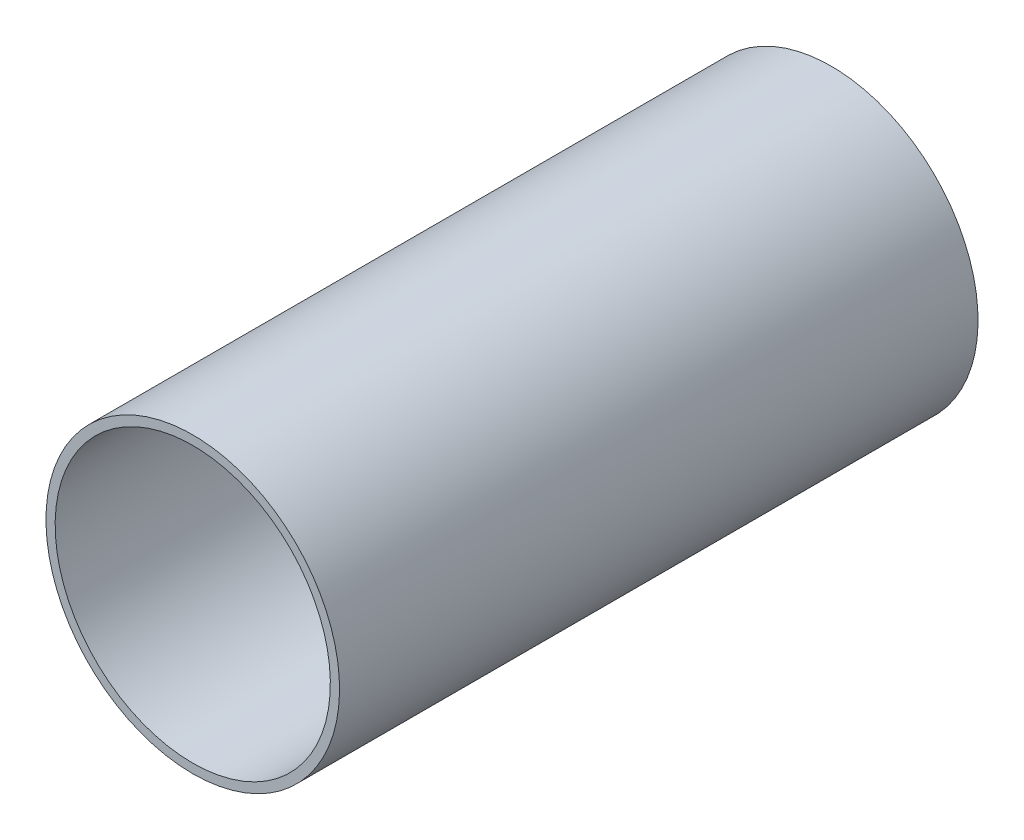
ISO-10303-21;
HEADER;
FILE_DESCRIPTION(('STEP AP214'),'2;1');
FILE_NAME('part.step','',(''),(''),'','','');
FILE_SCHEMA(('AUTOMOTIVE_DESIGN { 1 0 10303 214 1 1 1 1 }'));
ENDSEC;
DATA;
#1=APPLICATION_CONTEXT('core data for automotive mechanical design processes');
#2=APPLICATION_PROTOCOL_DEFINITION('international standard','automotive_design',2000,#1);
#3=PRODUCT_CONTEXT('',#1,'mechanical');
#4=PRODUCT('Part','Part','',(#3));
#5=PRODUCT_RELATED_PRODUCT_CATEGORY('part','',(#4));
#6=PRODUCT_DEFINITION_FORMATION('','',#4);
#7=PRODUCT_DEFINITION_CONTEXT('part definition',#1,'design');
#8=PRODUCT_DEFINITION('design','',#6,#7);
#9=PRODUCT_DEFINITION_SHAPE('','',#8);
#10=(LENGTH_UNIT() NAMED_UNIT(*) SI_UNIT(.MILLI.,.METRE.));
#11=(NAMED_UNIT(*) PLANE_ANGLE_UNIT() SI_UNIT($,.RADIAN.));
#12=(NAMED_UNIT(*) SI_UNIT($,.STERADIAN.) SOLID_ANGLE_UNIT());
#13=UNCERTAINTY_MEASURE_WITH_UNIT(LENGTH_MEASURE(1.E-05),#10,'distance_accuracy_value','');
#14=(GEOMETRIC_REPRESENTATION_CONTEXT(3) GLOBAL_UNCERTAINTY_ASSIGNED_CONTEXT((#13)) GLOBAL_UNIT_ASSIGNED_CONTEXT((#10,
#11,#12)) REPRESENTATION_CONTEXT('',''));
#15=CARTESIAN_POINT('',(0.,0.,0.));
#16=DIRECTION('',(0.,0.,1.));
#17=DIRECTION('',(1.,0.,0.));
#18=AXIS2_PLACEMENT_3D('',#15,#16,#17);
#19=CARTESIAN_POINT('',(141.224,-73.152,-0.045));
#20=DIRECTION('',(0.,0.,-1.));
#21=DIRECTION('',(0.,-1.,0.));
#22=AXIS2_PLACEMENT_3D('',#19,#20,#21);
#23=CYLINDRICAL_SURFACE('',#22,0.375);
#24=CARTESIAN_POINT('',(141.224,-73.152,-0.035));
#25=DIRECTION('',(0.,0.,-1.));
#26=DIRECTION('',(0.,-1.,0.));
#27=AXIS2_PLACEMENT_3D('',#24,#25,#26);
#28=CIRCLE('',#27,0.375);
#29=CARTESIAN_POINT('',(141.224,-73.527,-0.035));
#30=VERTEX_POINT('',#29);
#31=EDGE_CURVE('E64',#30,#30,#28,.T.);
#32=ORIENTED_EDGE('',*,*,#31,.T.);
#33=DIRECTION('',(0.,0.,1.));
#34=VECTOR('',#33,1.);
#35=CARTESIAN_POINT('',(141.224,-73.527,-0.045));
#36=LINE('',#35,#34);
#37=CARTESIAN_POINT('',(141.224,-73.527,1.705));
#38=VERTEX_POINT('',#37);
#39=EDGE_CURVE('E11',#30,#38,#36,.T.);
#40=ORIENTED_EDGE('',*,*,#39,.T.);
#41=CARTESIAN_POINT('',(141.224,-73.152,1.705));
#42=DIRECTION('',(0.,0.,-1.));
#43=DIRECTION('',(0.,-1.,0.));
#44=AXIS2_PLACEMENT_3D('',#41,#42,#43);
#45=CIRCLE('',#44,0.375);
#46=EDGE_CURVE('E25',#38,#38,#45,.T.);
#47=ORIENTED_EDGE('',*,*,#46,.F.);
#48=ORIENTED_EDGE('',*,*,#39,.F.);
#49=EDGE_LOOP('',(#32,#40,#47,#48));
#50=FACE_BOUND('',#49,.T.);
#51=ADVANCED_FACE('F17',(#50),#23,.F.);
#52=CARTESIAN_POINT('',(141.224,-73.552,1.705));
#53=DIRECTION('',(0.,0.,1.));
#54=DIRECTION('',(1.,0.,0.));
#55=AXIS2_PLACEMENT_3D('',#52,#53,#54);
#56=PLANE('',#55);
#57=ORIENTED_EDGE('',*,*,#46,.T.);
#58=EDGE_LOOP('',(#57));
#59=FACE_BOUND('',#58,.T.);
#60=CARTESIAN_POINT('',(141.224,-73.152,1.705));
#61=DIRECTION('',(0.,0.,1.));
#62=DIRECTION('',(0.,-1.,0.));
#63=AXIS2_PLACEMENT_3D('',#60,#61,#62);
#64=CIRCLE('',#63,0.4);
#65=CARTESIAN_POINT('',(141.224,-73.552,1.705));
#66=VERTEX_POINT('',#65);
#67=EDGE_CURVE('E56',#66,#66,#64,.T.);
#68=ORIENTED_EDGE('',*,*,#67,.T.);
#69=EDGE_LOOP('',(#68));
#70=FACE_BOUND('',#69,.T.);
#71=ADVANCED_FACE('F76',(#59,#70),#56,.T.);
#72=CARTESIAN_POINT('',(141.224,-73.552,-0.035));
#73=DIRECTION('',(0.,0.,1.));
#74=DIRECTION('',(1.,0.,0.));
#75=AXIS2_PLACEMENT_3D('',#72,#73,#74);
#76=PLANE('',#75);
#77=ORIENTED_EDGE('',*,*,#31,.F.);
#78=EDGE_LOOP('',(#77));
#79=FACE_BOUND('',#78,.T.);
#80=CARTESIAN_POINT('',(141.224,-73.152,-0.035));
#81=DIRECTION('',(0.,0.,1.));
#82=DIRECTION('',(0.,-1.,0.));
#83=AXIS2_PLACEMENT_3D('',#80,#81,#82);
#84=CIRCLE('',#83,0.4);
#85=CARTESIAN_POINT('',(141.224,-73.552,-0.035));
#86=VERTEX_POINT('',#85);
#87=EDGE_CURVE('E55',#86,#86,#84,.T.);
#88=ORIENTED_EDGE('',*,*,#87,.F.);
#89=EDGE_LOOP('',(#88));
#90=FACE_BOUND('',#89,.T.);
#91=ADVANCED_FACE('F84',(#79,#90),#76,.F.);
#92=CARTESIAN_POINT('',(141.224,-73.152,-0.035));
#93=DIRECTION('',(0.,0.,-1.));
#94=DIRECTION('',(0.,-1.,0.));
#95=AXIS2_PLACEMENT_3D('',#92,#93,#94);
#96=CYLINDRICAL_SURFACE('',#95,0.4);
#97=ORIENTED_EDGE('',*,*,#87,.T.);
#98=DIRECTION('',(0.,0.,1.));
#99=VECTOR('',#98,1.);
#100=CARTESIAN_POINT('',(141.224,-73.552,-0.035));
#101=LINE('',#100,#99);
#102=EDGE_CURVE('E52',#86,#66,#101,.T.);
#103=ORIENTED_EDGE('',*,*,#102,.T.);
#104=ORIENTED_EDGE('',*,*,#67,.F.);
#105=ORIENTED_EDGE('',*,*,#102,.F.);
#106=EDGE_LOOP('',(#97,#103,#104,#105));
#107=FACE_BOUND('',#106,.T.);
#108=ADVANCED_FACE('F53',(#107),#96,.T.);
#109=CLOSED_SHELL('',(#51,#71,#91,#108));
#110=MANIFOLD_SOLID_BREP('B1',#109);
#111=ADVANCED_BREP_SHAPE_REPRESENTATION('',(#18,#110),#14);
#112=SHAPE_DEFINITION_REPRESENTATION(#9,#111);
ENDSEC;
END-ISO-10303-21;
